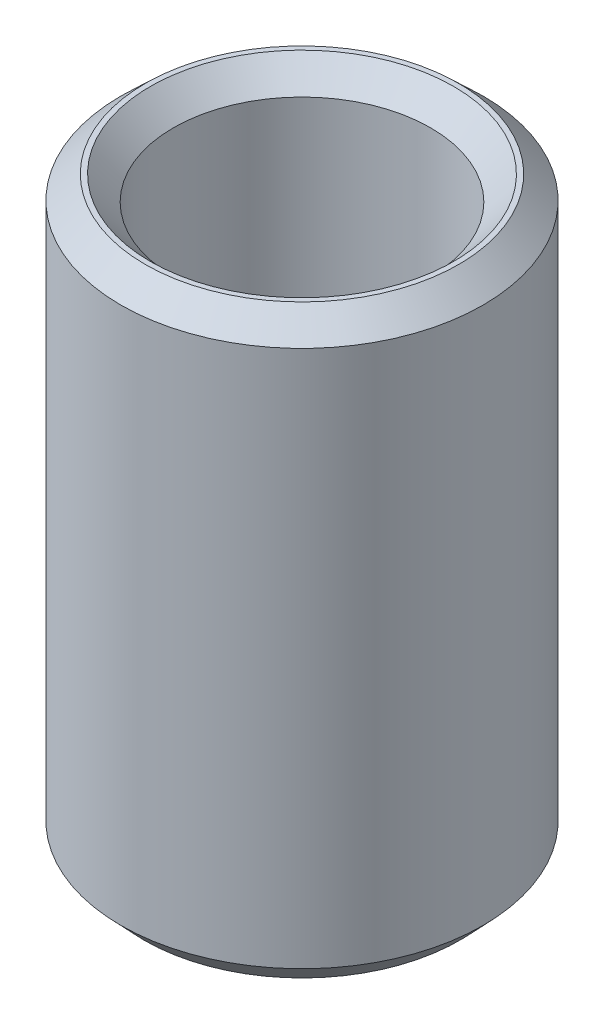
ISO-10303-21;
HEADER;
FILE_DESCRIPTION(('STEP AP214'),'2;1');
FILE_NAME('part.step','',(''),(''),'','','');
FILE_SCHEMA(('AUTOMOTIVE_DESIGN { 1 0 10303 214 1 1 1 1 }'));
ENDSEC;
DATA;
#1=APPLICATION_CONTEXT('core data for automotive mechanical design processes');
#2=APPLICATION_PROTOCOL_DEFINITION('international standard','automotive_design',2000,#1);
#3=PRODUCT_CONTEXT('',#1,'mechanical');
#4=PRODUCT('Part','Part','',(#3));
#5=PRODUCT_RELATED_PRODUCT_CATEGORY('part','',(#4));
#6=PRODUCT_DEFINITION_FORMATION('','',#4);
#7=PRODUCT_DEFINITION_CONTEXT('part definition',#1,'design');
#8=PRODUCT_DEFINITION('design','',#6,#7);
#9=PRODUCT_DEFINITION_SHAPE('','',#8);
#10=(LENGTH_UNIT() NAMED_UNIT(*) SI_UNIT(.MILLI.,.METRE.));
#11=(NAMED_UNIT(*) PLANE_ANGLE_UNIT() SI_UNIT($,.RADIAN.));
#12=(NAMED_UNIT(*) SI_UNIT($,.STERADIAN.) SOLID_ANGLE_UNIT());
#13=UNCERTAINTY_MEASURE_WITH_UNIT(LENGTH_MEASURE(1.E-05),#10,'distance_accuracy_value','');
#14=(GEOMETRIC_REPRESENTATION_CONTEXT(3) GLOBAL_UNCERTAINTY_ASSIGNED_CONTEXT((#13)) GLOBAL_UNIT_ASSIGNED_CONTEXT((#10,
#11,#12)) REPRESENTATION_CONTEXT('',''));
#15=CARTESIAN_POINT('',(0.,0.,0.));
#16=DIRECTION('',(0.,0.,1.));
#17=DIRECTION('',(1.,0.,0.));
#18=AXIS2_PLACEMENT_3D('',#15,#16,#17);
#19=CARTESIAN_POINT('',(0.,48.4214840130015,0.));
#20=DIRECTION('',(0.,-1.,0.));
#21=DIRECTION('',(0.,0.,-1.));
#22=AXIS2_PLACEMENT_3D('',#19,#20,#21);
#23=CYLINDRICAL_SURFACE('',#22,15.);
#24=CARTESIAN_POINT('',(0.,2.01373774233758,0.));
#25=DIRECTION('',(0.,1.,0.));
#26=DIRECTION('',(0.,0.,1.));
#27=AXIS2_PLACEMENT_3D('',#24,#25,#26);
#28=CIRCLE('',#27,15.);
#29=CARTESIAN_POINT('',(0.,2.01373774233758,15.));
#30=VERTEX_POINT('',#29);
#31=EDGE_CURVE('E10',#30,#30,#28,.T.);
#32=ORIENTED_EDGE('',*,*,#31,.T.);
#33=EDGE_LOOP('',(#32));
#34=FACE_BOUND('',#33,.T.);
#35=CARTESIAN_POINT('',(0.,46.5124814897845,0.));
#36=DIRECTION('',(0.,1.,0.));
#37=DIRECTION('',(0.,0.,1.));
#38=AXIS2_PLACEMENT_3D('',#35,#36,#37);
#39=CIRCLE('',#38,15.);
#40=CARTESIAN_POINT('',(0.,46.5124814897845,15.));
#41=VERTEX_POINT('',#40);
#42=EDGE_CURVE('E50',#41,#41,#39,.F.);
#43=ORIENTED_EDGE('',*,*,#42,.T.);
#44=EDGE_LOOP('',(#43));
#45=FACE_BOUND('',#44,.T.);
#46=ADVANCED_FACE('F39',(#34,#45),#23,.T.);
#47=CARTESIAN_POINT('',(0.,48.4214840130015,0.));
#48=DIRECTION('',(0.,1.,0.));
#49=DIRECTION('',(0.,0.,1.));
#50=AXIS2_PLACEMENT_3D('',#47,#48,#49);
#51=PLANE('',#50);
#52=CARTESIAN_POINT('',(0.,48.4214840130015,0.));
#53=DIRECTION('',(0.,1.,0.));
#54=DIRECTION('',(0.,0.,1.));
#55=AXIS2_PLACEMENT_3D('',#52,#53,#54);
#56=CIRCLE('',#55,12.5617374518582);
#57=CARTESIAN_POINT('',(0.,48.4214840130015,12.5617374518582));
#58=VERTEX_POINT('',#57);
#59=EDGE_CURVE('E58',#58,#58,#56,.F.);
#60=ORIENTED_EDGE('',*,*,#59,.T.);
#61=EDGE_LOOP('',(#60));
#62=FACE_BOUND('',#61,.T.);
#63=CARTESIAN_POINT('',(0.,48.4214840130015,0.));
#64=DIRECTION('',(0.,1.,0.));
#65=DIRECTION('',(0.,0.,1.));
#66=AXIS2_PLACEMENT_3D('',#63,#64,#65);
#67=CIRCLE('',#66,12.9862622576624);
#68=CARTESIAN_POINT('',(0.,48.4214840130015,12.9862622576624));
#69=VERTEX_POINT('',#68);
#70=EDGE_CURVE('E61',#69,#69,#67,.T.);
#71=ORIENTED_EDGE('',*,*,#70,.T.);
#72=EDGE_LOOP('',(#71));
#73=FACE_BOUND('',#72,.T.);
#74=ADVANCED_FACE('F88',(#62,#73),#51,.T.);
#75=CARTESIAN_POINT('',(0.,0.,0.));
#76=DIRECTION('',(0.,1.,0.));
#77=DIRECTION('',(0.,0.,1.));
#78=AXIS2_PLACEMENT_3D('',#75,#76,#77);
#79=PLANE('',#78);
#80=CARTESIAN_POINT('',(0.,0.,0.));
#81=DIRECTION('',(0.,1.,0.));
#82=DIRECTION('',(0.,0.,1.));
#83=AXIS2_PLACEMENT_3D('',#80,#81,#82);
#84=CIRCLE('',#83,12.6664726709787);
#85=CARTESIAN_POINT('',(0.,0.,-12.6664726709787));
#86=VERTEX_POINT('',#85);
#87=EDGE_CURVE('E51',#86,#86,#84,.T.);
#88=ORIENTED_EDGE('',*,*,#87,.T.);
#89=EDGE_LOOP('',(#88));
#90=FACE_BOUND('',#89,.T.);
#91=CARTESIAN_POINT('',(0.,0.,0.));
#92=DIRECTION('',(0.,1.,0.));
#93=DIRECTION('',(0.,0.,1.));
#94=AXIS2_PLACEMENT_3D('',#91,#92,#93);
#95=CIRCLE('',#94,13.090997476783);
#96=CARTESIAN_POINT('',(0.,0.,13.090997476783));
#97=VERTEX_POINT('',#96);
#98=EDGE_CURVE('E54',#97,#97,#95,.F.);
#99=ORIENTED_EDGE('',*,*,#98,.T.);
#100=EDGE_LOOP('',(#99));
#101=FACE_BOUND('',#100,.T.);
#102=ADVANCED_FACE('F83',(#90,#101),#79,.F.);
#103=CARTESIAN_POINT('',(0.,48.4214840130015,0.));
#104=DIRECTION('',(0.,-1.,0.));
#105=DIRECTION('',(0.,0.,-1.));
#106=AXIS2_PLACEMENT_3D('',#103,#104,#105);
#107=CYLINDRICAL_SURFACE('',#106,10.6527349286411);
#108=CARTESIAN_POINT('',(0.,46.4077462706639,0.));
#109=DIRECTION('',(0.,1.,0.));
#110=DIRECTION('',(0.,0.,1.));
#111=AXIS2_PLACEMENT_3D('',#108,#109,#110);
#112=CIRCLE('',#111,10.6527349286411);
#113=CARTESIAN_POINT('',(0.,46.4077462706639,10.6527349286411));
#114=VERTEX_POINT('',#113);
#115=EDGE_CURVE('E67',#114,#114,#112,.T.);
#116=ORIENTED_EDGE('',*,*,#115,.T.);
#117=EDGE_LOOP('',(#116));
#118=FACE_BOUND('',#117,.T.);
#119=CARTESIAN_POINT('',(0.,1.90900252321703,0.));
#120=DIRECTION('',(0.,1.,0.));
#121=DIRECTION('',(0.,0.,1.));
#122=AXIS2_PLACEMENT_3D('',#119,#120,#121);
#123=CIRCLE('',#122,10.6527349286411);
#124=CARTESIAN_POINT('',(0.,1.90900252321702,-10.6527349286411));
#125=VERTEX_POINT('',#124);
#126=EDGE_CURVE('E69',#125,#125,#123,.F.);
#127=ORIENTED_EDGE('',*,*,#126,.T.);
#128=EDGE_LOOP('',(#127));
#129=FACE_BOUND('',#128,.T.);
#130=ADVANCED_FACE('F71',(#118,#129),#107,.F.);
#131=CARTESIAN_POINT('',(0.,46.4077462706639,0.));
#132=DIRECTION('',(0.,1.,0.));
#133=DIRECTION('',(0.,0.,1.));
#134=AXIS2_PLACEMENT_3D('',#131,#132,#133);
#135=CONICAL_SURFACE('',#134,10.6527349286411,0.758705001126669);
#136=ORIENTED_EDGE('',*,*,#59,.F.);
#137=EDGE_LOOP('',(#136));
#138=FACE_BOUND('',#137,.T.);
#139=ORIENTED_EDGE('',*,*,#115,.F.);
#140=EDGE_LOOP('',(#139));
#141=FACE_BOUND('',#140,.T.);
#142=ADVANCED_FACE('F77',(#138,#141),#135,.F.);
#143=CARTESIAN_POINT('',(0.,0.,0.));
#144=DIRECTION('',(0.,-1.,0.));
#145=DIRECTION('',(0.,0.,-1.));
#146=AXIS2_PLACEMENT_3D('',#143,#144,#145);
#147=CONICAL_SURFACE('',#146,12.6664726709787,0.812091325668227);
#148=CARTESIAN_POINT('',(0.,1.90900252321702,-10.6527349286411));
#149=CARTESIAN_POINT('',(0.,1.88911708026685,-10.6737113634571));
#150=CARTESIAN_POINT('',(0.,1.86923163731667,-10.6946877982732));
#151=CARTESIAN_POINT('',(0.,1.82946075141632,-10.7366406679052));
#152=CARTESIAN_POINT('',(0.,1.80957530846614,-10.7576171027212));
#153=CARTESIAN_POINT('',(0.,1.76980442256578,-10.7995699723532));
#154=CARTESIAN_POINT('',(0.,1.74991897961561,-10.8205464071693));
#155=CARTESIAN_POINT('',(0.,1.71014809371525,-10.8624992768013));
#156=CARTESIAN_POINT('',(0.,1.69026265076507,-10.8834757116173));
#157=CARTESIAN_POINT('',(0.,1.65049176486472,-10.9254285812493));
#158=CARTESIAN_POINT('',(0.,1.63060632191454,-10.9464050160654));
#159=CARTESIAN_POINT('',(0.,1.59083543601419,-10.9883578856974));
#160=CARTESIAN_POINT('',(0.,1.57094999306401,-11.0093343205134));
#161=CARTESIAN_POINT('',(0.,1.53117910716366,-11.0512871901454));
#162=CARTESIAN_POINT('',(0.,1.51129366421348,-11.0722636249615));
#163=CARTESIAN_POINT('',(0.,1.47152277831312,-11.1142164945935));
#164=CARTESIAN_POINT('',(0.,1.45163733536295,-11.1351929294095));
#165=CARTESIAN_POINT('',(0.,1.41186644946259,-11.1771457990415));
#166=CARTESIAN_POINT('',(0.,1.39198100651241,-11.1981222338576));
#167=CARTESIAN_POINT('',(0.,1.35221012061206,-11.2400751034896));
#168=CARTESIAN_POINT('',(0.,1.33232467766188,-11.2610515383056));
#169=CARTESIAN_POINT('',(0.,1.29255379176153,-11.3030044079376));
#170=CARTESIAN_POINT('',(0.,1.27266834881135,-11.3239808427537));
#171=CARTESIAN_POINT('',(0.,1.232897462911,-11.3659337123857));
#172=CARTESIAN_POINT('',(0.,1.21301201996082,-11.3869101472017));
#173=CARTESIAN_POINT('',(0.,1.17324113406046,-11.4288630168337));
#174=CARTESIAN_POINT('',(0.,1.15335569111029,-11.4498394516498));
#175=CARTESIAN_POINT('',(0.,1.11358480520993,-11.4917923212818));
#176=CARTESIAN_POINT('',(0.,1.09369936225975,-11.5127687560978));
#177=CARTESIAN_POINT('',(0.,1.0539284763594,-11.5547216257298));
#178=CARTESIAN_POINT('',(0.,1.03404303340922,-11.5756980605459));
#179=CARTESIAN_POINT('',(0.,0.994272147508867,-11.6176509301779));
#180=CARTESIAN_POINT('',(0.,0.97438670455869,-11.6386273649939));
#181=CARTESIAN_POINT('',(0.,0.934615818658335,-11.6805802346259));
#182=CARTESIAN_POINT('',(0.,0.914730375708158,-11.7015566694419));
#183=CARTESIAN_POINT('',(0.,0.874959489807803,-11.743509539074));
#184=CARTESIAN_POINT('',(0.,0.855074046857626,-11.76448597389));
#185=CARTESIAN_POINT('',(0.,0.815303160957271,-11.806438843522));
#186=CARTESIAN_POINT('',(0.,0.795417718007093,-11.827415278338));
#187=CARTESIAN_POINT('',(0.,0.755646832106739,-11.8693681479701));
#188=CARTESIAN_POINT('',(0.,0.735761389156562,-11.8903445827861));
#189=CARTESIAN_POINT('',(0.,0.695990503256207,-11.9322974524181));
#190=CARTESIAN_POINT('',(0.,0.676105060306029,-11.9532738872341));
#191=CARTESIAN_POINT('',(0.,0.636334174405675,-11.9952267568662));
#192=CARTESIAN_POINT('',(0.,0.616448731455498,-12.0162031916822));
#193=CARTESIAN_POINT('',(0.,0.576677845555143,-12.0581560613142));
#194=CARTESIAN_POINT('',(0.,0.556792402604966,-12.0791324961302));
#195=CARTESIAN_POINT('',(0.,0.517021516704611,-12.1210853657623));
#196=CARTESIAN_POINT('',(0.,0.497136073754433,-12.1420618005783));
#197=CARTESIAN_POINT('',(0.,0.457365187854079,-12.1840146702103));
#198=CARTESIAN_POINT('',(0.,0.437479744903902,-12.2049911050263));
#199=CARTESIAN_POINT('',(0.,0.397708859003547,-12.2469439746584));
#200=CARTESIAN_POINT('',(0.,0.37782341605337,-12.2679204094744));
#201=CARTESIAN_POINT('',(0.,0.338052530153015,-12.3098732791064));
#202=CARTESIAN_POINT('',(0.,0.318167087202837,-12.3308497139224));
#203=CARTESIAN_POINT('',(0.,0.278396201302483,-12.3728025835545));
#204=CARTESIAN_POINT('',(0.,0.258510758352306,-12.3937790183705));
#205=CARTESIAN_POINT('',(0.,0.218739872451951,-12.4357318880025));
#206=CARTESIAN_POINT('',(0.,0.198854429501774,-12.4567083228185));
#207=CARTESIAN_POINT('',(0.,0.159083543601419,-12.4986611924506));
#208=CARTESIAN_POINT('',(0.,0.139198100651241,-12.5196376272666));
#209=CARTESIAN_POINT('',(0.,0.0994272147508866,-12.5615904968986));
#210=CARTESIAN_POINT('',(0.,0.0795417718007094,-12.5825669317146));
#211=CARTESIAN_POINT('',(0.,0.039770885900355,-12.6245198013467));
#212=CARTESIAN_POINT('',(0.,0.0198854429501777,-12.6454962361627));
#213=CARTESIAN_POINT('',(0.,0.,-12.6664726709787));
#214=B_SPLINE_CURVE_WITH_KNOTS('',3,(#148,#149,#150,#151,#152,#153,#154,#155,#156,#157,#158,
#159,#160,#161,#162,#163,#164,#165,#166,#167,#168,#169,#170,#171,#172,#173,#174,#175,#176,#177,
#178,#179,#180,#181,#182,#183,#184,#185,#186,#187,#188,#189,#190,#191,#192,#193,#194,#195,#196,
#197,#198,#199,#200,#201,#202,#203,#204,#205,#206,#207,#208,#209,#210,#211,#212,#213),
.UNSPECIFIED.,.F.,.F.,(4,2,2,2,2,2,2,2,2,2,2,2,2,2,2,2,2,2,2,2,2,2,2,2,2,2,2,2,2,2,2,2,4),(0.,
0.0867120229855004,0.173424045971002,0.260136068956502,0.346848091942003,0.433560114927505,
0.520272137913005,0.606984160898505,0.693696183884007,0.780408206869507,0.867120229855008,
0.95383225284051,1.04054427582601,1.12725629881151,1.21396832179701,1.30068034478251,
1.38739236776801,1.47410439075351,1.56081641373901,1.64752843672451,1.73424045971002,
1.82095248269552,1.90766450568102,1.99437652866652,2.08108855165202,2.16780057463752,
2.25451259762302,2.34122462060852,2.42793664359402,2.51464866657952,2.60136068956502,
2.68807271255052,2.77478473553602),.UNSPECIFIED.);
#215=EDGE_CURVE('BSEAM73',#125,#86,#214,.T.);
#216=ORIENTED_EDGE('',*,*,#126,.F.);
#217=ORIENTED_EDGE('',*,*,#87,.F.);
#218=ORIENTED_EDGE('',*,*,#215,.T.);
#219=ORIENTED_EDGE('',*,*,#215,.F.);
#220=EDGE_LOOP('',(#216,#218,#217,#219));
#221=FACE_BOUND('',#220,.T.);
#222=ADVANCED_FACE('F73',(#221),#147,.F.);
#223=CARTESIAN_POINT('',(0.,2.01373774233758,0.));
#224=DIRECTION('',(0.,1.,0.));
#225=DIRECTION('',(0.,0.,1.));
#226=AXIS2_PLACEMENT_3D('',#223,#224,#225);
#227=CONICAL_SURFACE('',#226,15.,0.758705001126669);
#228=ORIENTED_EDGE('',*,*,#98,.F.);
#229=EDGE_LOOP('',(#228));
#230=FACE_BOUND('',#229,.T.);
#231=ORIENTED_EDGE('',*,*,#31,.F.);
#232=EDGE_LOOP('',(#231));
#233=FACE_BOUND('',#232,.T.);
#234=ADVANCED_FACE('F76',(#230,#233),#227,.T.);
#235=CARTESIAN_POINT('',(0.,48.4214840130015,0.));
#236=DIRECTION('',(0.,-1.,0.));
#237=DIRECTION('',(0.,0.,-1.));
#238=AXIS2_PLACEMENT_3D('',#235,#236,#237);
#239=CONICAL_SURFACE('',#238,12.9862622576624,0.812091325668227);
#240=ORIENTED_EDGE('',*,*,#42,.F.);
#241=EDGE_LOOP('',(#240));
#242=FACE_BOUND('',#241,.T.);
#243=ORIENTED_EDGE('',*,*,#70,.F.);
#244=EDGE_LOOP('',(#243));
#245=FACE_BOUND('',#244,.T.);
#246=ADVANCED_FACE('F45',(#242,#245),#239,.T.);
#247=CLOSED_SHELL('',(#46,#74,#102,#130,#142,#222,#234,#246));
#248=MANIFOLD_SOLID_BREP('B2',#247);
#249=ADVANCED_BREP_SHAPE_REPRESENTATION('',(#18,#248),#14);
#250=SHAPE_DEFINITION_REPRESENTATION(#9,#249);
ENDSEC;
END-ISO-10303-21;
